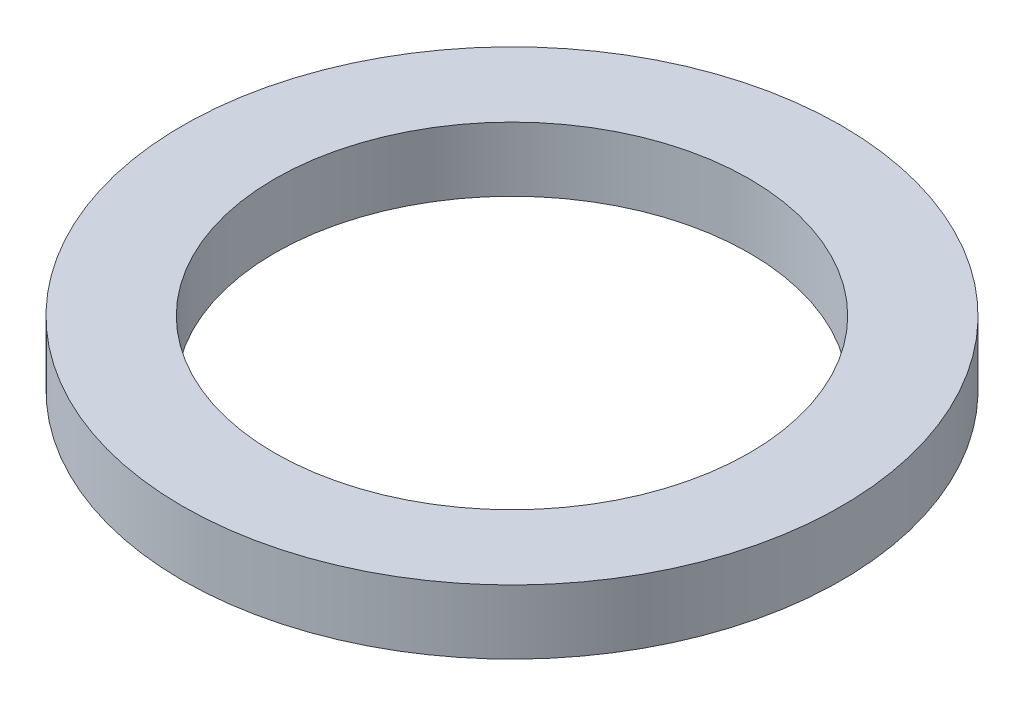
ISO-10303-21;
HEADER;
FILE_DESCRIPTION(('STEP AP214'),'2;1');
FILE_NAME('part.step','',(''),(''),'','','');
FILE_SCHEMA(('AUTOMOTIVE_DESIGN { 1 0 10303 214 1 1 1 1 }'));
ENDSEC;
DATA;
#1=APPLICATION_CONTEXT('core data for automotive mechanical design processes');
#2=APPLICATION_PROTOCOL_DEFINITION('international standard','automotive_design',2000,#1);
#3=PRODUCT_CONTEXT('',#1,'mechanical');
#4=PRODUCT('Part','Part','',(#3));
#5=PRODUCT_RELATED_PRODUCT_CATEGORY('part','',(#4));
#6=PRODUCT_DEFINITION_FORMATION('','',#4);
#7=PRODUCT_DEFINITION_CONTEXT('part definition',#1,'design');
#8=PRODUCT_DEFINITION('design','',#6,#7);
#9=PRODUCT_DEFINITION_SHAPE('','',#8);
#10=(LENGTH_UNIT() NAMED_UNIT(*) SI_UNIT(.MILLI.,.METRE.));
#11=(NAMED_UNIT(*) PLANE_ANGLE_UNIT() SI_UNIT($,.RADIAN.));
#12=(NAMED_UNIT(*) SI_UNIT($,.STERADIAN.) SOLID_ANGLE_UNIT());
#13=UNCERTAINTY_MEASURE_WITH_UNIT(LENGTH_MEASURE(1.E-05),#10,'distance_accuracy_value','');
#14=(GEOMETRIC_REPRESENTATION_CONTEXT(3) GLOBAL_UNCERTAINTY_ASSIGNED_CONTEXT((#13)) GLOBAL_UNIT_ASSIGNED_CONTEXT((#10,
#11,#12)) REPRESENTATION_CONTEXT('',''));
#15=CARTESIAN_POINT('',(0.,0.,0.));
#16=DIRECTION('',(0.,0.,1.));
#17=DIRECTION('',(1.,0.,0.));
#18=AXIS2_PLACEMENT_3D('',#15,#16,#17);
#19=CARTESIAN_POINT('',(0.,1.15,0.));
#20=DIRECTION('',(0.,1.,0.));
#21=DIRECTION('',(0.,0.,1.));
#22=AXIS2_PLACEMENT_3D('',#19,#20,#21);
#23=PLANE('',#22);
#24=CARTESIAN_POINT('',(0.,1.15,0.));
#25=DIRECTION('',(0.,1.,0.));
#26=DIRECTION('',(0.,0.,1.));
#27=AXIS2_PLACEMENT_3D('',#24,#25,#26);
#28=CIRCLE('',#27,5.9);
#29=CARTESIAN_POINT('',(0.,1.15,5.9));
#30=VERTEX_POINT('',#29);
#31=EDGE_CURVE('E10',#30,#30,#28,.T.);
#32=ORIENTED_EDGE('',*,*,#31,.T.);
#33=EDGE_LOOP('',(#32));
#34=FACE_BOUND('',#33,.T.);
#35=CARTESIAN_POINT('',(0.,1.15,0.));
#36=DIRECTION('',(0.,1.,0.));
#37=DIRECTION('',(0.,0.,1.));
#38=AXIS2_PLACEMENT_3D('',#35,#36,#37);
#39=CIRCLE('',#38,4.25);
#40=CARTESIAN_POINT('',(0.,1.15,4.25));
#41=VERTEX_POINT('',#40);
#42=EDGE_CURVE('E50',#41,#41,#39,.T.);
#43=ORIENTED_EDGE('',*,*,#42,.F.);
#44=EDGE_LOOP('',(#43));
#45=FACE_BOUND('',#44,.T.);
#46=ADVANCED_FACE('F37',(#34,#45),#23,.T.);
#47=CARTESIAN_POINT('',(0.,0.,0.));
#48=DIRECTION('',(0.,1.,0.));
#49=DIRECTION('',(0.,0.,1.));
#50=AXIS2_PLACEMENT_3D('',#47,#48,#49);
#51=PLANE('',#50);
#52=CARTESIAN_POINT('',(0.,0.,0.));
#53=DIRECTION('',(0.,1.,0.));
#54=DIRECTION('',(0.,0.,1.));
#55=AXIS2_PLACEMENT_3D('',#52,#53,#54);
#56=CIRCLE('',#55,5.9);
#57=CARTESIAN_POINT('',(0.,0.,5.9));
#58=VERTEX_POINT('',#57);
#59=EDGE_CURVE('E41',#58,#58,#56,.T.);
#60=ORIENTED_EDGE('',*,*,#59,.F.);
#61=EDGE_LOOP('',(#60));
#62=FACE_BOUND('',#61,.T.);
#63=CARTESIAN_POINT('',(0.,0.,0.));
#64=DIRECTION('',(0.,1.,0.));
#65=DIRECTION('',(0.,0.,1.));
#66=AXIS2_PLACEMENT_3D('',#63,#64,#65);
#67=CIRCLE('',#66,4.25);
#68=CARTESIAN_POINT('',(0.,0.,4.25));
#69=VERTEX_POINT('',#68);
#70=EDGE_CURVE('E52',#69,#69,#67,.T.);
#71=ORIENTED_EDGE('',*,*,#70,.T.);
#72=EDGE_LOOP('',(#71));
#73=FACE_BOUND('',#72,.T.);
#74=ADVANCED_FACE('F64',(#62,#73),#51,.F.);
#75=CARTESIAN_POINT('',(0.,1.15,0.));
#76=DIRECTION('',(0.,-1.,0.));
#77=DIRECTION('',(0.,0.,-1.));
#78=AXIS2_PLACEMENT_3D('',#75,#76,#77);
#79=CYLINDRICAL_SURFACE('',#78,5.9);
#80=ORIENTED_EDGE('',*,*,#31,.F.);
#81=EDGE_LOOP('',(#80));
#82=FACE_BOUND('',#81,.T.);
#83=ORIENTED_EDGE('',*,*,#59,.T.);
#84=EDGE_LOOP('',(#83));
#85=FACE_BOUND('',#84,.T.);
#86=ADVANCED_FACE('F39',(#82,#85),#79,.T.);
#87=CARTESIAN_POINT('',(0.,1.15,0.));
#88=DIRECTION('',(0.,-1.,0.));
#89=DIRECTION('',(0.,0.,-1.));
#90=AXIS2_PLACEMENT_3D('',#87,#88,#89);
#91=CYLINDRICAL_SURFACE('',#90,4.25);
#92=ORIENTED_EDGE('',*,*,#42,.T.);
#93=EDGE_LOOP('',(#92));
#94=FACE_BOUND('',#93,.T.);
#95=ORIENTED_EDGE('',*,*,#70,.F.);
#96=EDGE_LOOP('',(#95));
#97=FACE_BOUND('',#96,.T.);
#98=ADVANCED_FACE('F60',(#94,#97),#91,.F.);
#99=CLOSED_SHELL('',(#46,#74,#86,#98));
#100=MANIFOLD_SOLID_BREP('B2',#99);
#101=ADVANCED_BREP_SHAPE_REPRESENTATION('',(#18,#100),#14);
#102=SHAPE_DEFINITION_REPRESENTATION(#9,#101);
ENDSEC;
END-ISO-10303-21;
